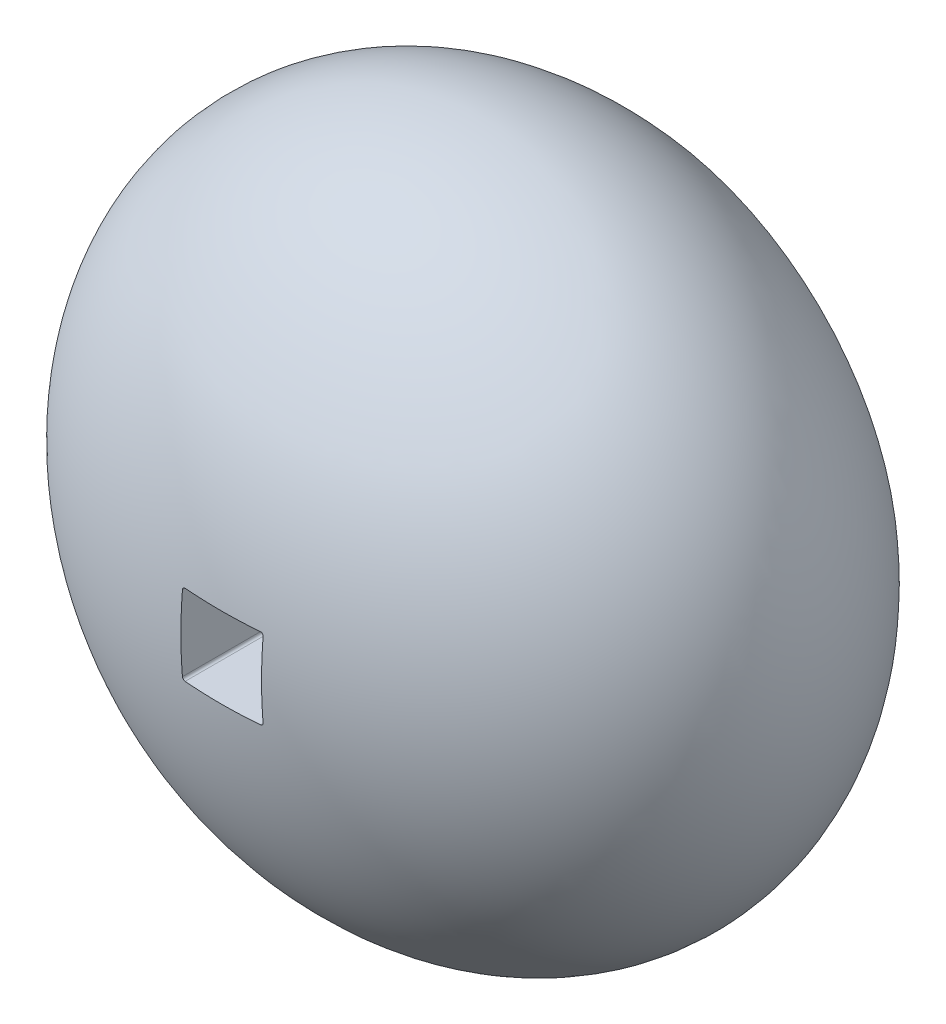
ISO-10303-21;
HEADER;
FILE_DESCRIPTION(('STEP AP214'),'2;1');
FILE_NAME('part.step','',(''),(''),'','','');
FILE_SCHEMA(('AUTOMOTIVE_DESIGN { 1 0 10303 214 1 1 1 1 }'));
ENDSEC;
DATA;
#1=APPLICATION_CONTEXT('core data for automotive mechanical design processes');
#2=APPLICATION_PROTOCOL_DEFINITION('international standard','automotive_design',2000,#1);
#3=PRODUCT_CONTEXT('',#1,'mechanical');
#4=PRODUCT('Part','Part','',(#3));
#5=PRODUCT_RELATED_PRODUCT_CATEGORY('part','',(#4));
#6=PRODUCT_DEFINITION_FORMATION('','',#4);
#7=PRODUCT_DEFINITION_CONTEXT('part definition',#1,'design');
#8=PRODUCT_DEFINITION('design','',#6,#7);
#9=PRODUCT_DEFINITION_SHAPE('','',#8);
#10=(LENGTH_UNIT() NAMED_UNIT(*) SI_UNIT(.MILLI.,.METRE.));
#11=(NAMED_UNIT(*) PLANE_ANGLE_UNIT() SI_UNIT($,.RADIAN.));
#12=(NAMED_UNIT(*) SI_UNIT($,.STERADIAN.) SOLID_ANGLE_UNIT());
#13=UNCERTAINTY_MEASURE_WITH_UNIT(LENGTH_MEASURE(1.E-05),#10,'distance_accuracy_value','');
#14=(GEOMETRIC_REPRESENTATION_CONTEXT(3) GLOBAL_UNCERTAINTY_ASSIGNED_CONTEXT((#13)) GLOBAL_UNIT_ASSIGNED_CONTEXT((#10,
#11,#12)) REPRESENTATION_CONTEXT('',''));
#15=CARTESIAN_POINT('',(0.,0.,0.));
#16=DIRECTION('',(0.,0.,1.));
#17=DIRECTION('',(1.,0.,0.));
#18=AXIS2_PLACEMENT_3D('',#15,#16,#17);
#19=CARTESIAN_POINT('',(0.,0.,0.));
#20=DIRECTION('',(0.,0.,1.));
#21=DIRECTION('',(1.,0.,0.));
#22=AXIS2_PLACEMENT_3D('',#19,#20,#21);
#23=PLANE('',#22);
#24=CARTESIAN_POINT('',(0.,0.,0.));
#25=DIRECTION('',(0.,0.,1.));
#26=DIRECTION('',(1.,0.,0.));
#27=AXIS2_PLACEMENT_3D('',#24,#25,#26);
#28=CIRCLE('',#27,19.5);
#29=CARTESIAN_POINT('',(19.5,0.,0.));
#30=VERTEX_POINT('',#29);
#31=EDGE_CURVE('E12',#30,#30,#28,.T.);
#32=ORIENTED_EDGE('',*,*,#31,.F.);
#33=EDGE_LOOP('',(#32));
#34=FACE_BOUND('',#33,.T.);
#35=CARTESIAN_POINT('',(0.,0.,0.));
#36=DIRECTION('',(0.,0.,1.));
#37=DIRECTION('',(1.,0.,0.));
#38=AXIS2_PLACEMENT_3D('',#35,#36,#37);
#39=CIRCLE('',#38,18.5);
#40=CARTESIAN_POINT('',(18.5,0.,0.));
#41=VERTEX_POINT('',#40);
#42=EDGE_CURVE('E269',#41,#41,#39,.T.);
#43=ORIENTED_EDGE('',*,*,#42,.T.);
#44=EDGE_LOOP('',(#43));
#45=FACE_BOUND('',#44,.T.);
#46=ADVANCED_FACE('F63',(#34,#45),#23,.F.);
#47=CARTESIAN_POINT('',(0.,0.,12.1479038822749));
#48=DIRECTION('',(1.,0.,0.));
#49=DIRECTION('',(0.,1.,0.));
#50=AXIS2_PLACEMENT_3D('',#47,#48,#49);
#51=ELLIPSE('',#50,25.5,18.8520961177251);
#52=TRIMMED_CURVE('',#51,(PARAMETER_VALUE(4.71238898038469)),
(PARAMETER_VALUE(7.85398163397448)),.T.,.PARAMETER.);
#53=CARTESIAN_POINT('',(0.,0.,1186.45838773338));
#54=DIRECTION('',(0.,0.,1.));
#55=AXIS1_PLACEMENT('',#53,#54);
#56=SURFACE_OF_REVOLUTION('',#52,#55);
#57=CARTESIAN_POINT('',(-3.,-2.8,30.7542854389864));
#58=CARTESIAN_POINT('',(-3.,-2.61345255434219,30.7696287091607));
#59=CARTESIAN_POINT('',(-3.,-2.42677847376478,30.7834304929131));
#60=CARTESIAN_POINT('',(-3.,-2.05342901212041,30.8079424453394));
#61=CARTESIAN_POINT('',(-3.,-1.86675384827409,30.8186559222903));
#62=CARTESIAN_POINT('',(-3.,-1.49340304087798,30.8370082061758));
#63=CARTESIAN_POINT('',(-3.,-1.30672751853067,30.8446494797139));
#64=CARTESIAN_POINT('',(-3.,-0.933376468467886,30.8568693732832));
#65=CARTESIAN_POINT('',(-3.,-0.746700994413011,30.8614496331072));
#66=CARTESIAN_POINT('',(-3.,-0.373350337951583,30.8675550766698));
#67=CARTESIAN_POINT('',(-3.,-0.186675168975792,30.8690810819289));
#68=CARTESIAN_POINT('',(-3.,0.186675168975791,30.8690810819288));
#69=CARTESIAN_POINT('',(-3.,0.373350337951582,30.8675550766698));
#70=CARTESIAN_POINT('',(-3.,0.746700994413009,30.8614496331072));
#71=CARTESIAN_POINT('',(-3.,0.933376468467882,30.8568693732831));
#72=CARTESIAN_POINT('',(-3.,1.30672751853067,30.8446494797138));
#73=CARTESIAN_POINT('',(-3.,1.49340304087798,30.8370082061759));
#74=CARTESIAN_POINT('',(-3.,1.86675384827409,30.8186559222904));
#75=CARTESIAN_POINT('',(-3.,2.05342901212041,30.8079424453394));
#76=CARTESIAN_POINT('',(-3.,2.42677847376478,30.783430492913));
#77=CARTESIAN_POINT('',(-3.,2.61345255434218,30.7696287091606));
#78=CARTESIAN_POINT('',(-3.,2.8,30.7542854389864));
#79=B_SPLINE_CURVE_WITH_KNOTS('',3,(#57,#58,#59,#60,#61,#62,#63,#64,#65,#66,#67,#68,#69,#70,#71,
#72,#73,#74,#75,#76,#77,#78),.UNSPECIFIED.,.F.,.F.,(4,2,2,2,2,2,2,2,2,2,4),(0.,
0.561525478558583,1.122447181425,1.68291762911274,2.2430875901916,2.80310685888383,
3.36312612757606,3.92329608865492,4.48376653634266,5.04468823920908,5.60621371776766),.UNSPECIFIED.);
#80=CARTESIAN_POINT('',(-3.,-2.8,30.7542854389864));
#81=VERTEX_POINT('',#80);
#82=CARTESIAN_POINT('',(-3.,2.8,30.7542854389864));
#83=VERTEX_POINT('',#82);
#84=EDGE_CURVE('E145',#81,#83,#79,.T.);
#85=ORIENTED_EDGE('',*,*,#84,.T.);
#86=CARTESIAN_POINT('',(-3.,2.8,30.7542854389864));
#87=CARTESIAN_POINT('',(-3.00000967177594,2.81119629806838,30.7533637490118));
#88=CARTESIAN_POINT('',(-2.99906034918853,2.82239731191214,30.7525204812984));
#89=CARTESIAN_POINT('',(-2.99530761704706,2.84448997016492,30.751011821607));
#90=CARTESIAN_POINT('',(-2.99250531745599,2.85538179571165,30.7503463234769));
#91=CARTESIAN_POINT('',(-2.98510806868469,2.87655808072974,30.7492127254614));
#92=CARTESIAN_POINT('',(-2.98051199333973,2.88684215396382,30.7487447499692));
#93=CARTESIAN_POINT('',(-2.9696588935551,2.90649783159489,30.7480205097188));
#94=CARTESIAN_POINT('',(-2.96340228018263,2.91586966103469,30.7477641926291));
#95=CARTESIAN_POINT('',(-2.94942934888167,2.93340202468106,30.7474713249619));
#96=CARTESIAN_POINT('',(-2.9417183504843,2.94156678555443,30.7474339889353));
#97=CARTESIAN_POINT('',(-2.92504156585535,2.95649218014754,30.7475780929724));
#98=CARTESIAN_POINT('',(-2.91607580228529,2.96325283922039,30.7477595290854));
#99=CARTESIAN_POINT('',(-2.89716010767741,2.97517063337091,30.74833529823));
#100=CARTESIAN_POINT('',(-2.88721155569745,2.98032997445649,30.7487293363078));
#101=CARTESIAN_POINT('',(-2.86660366436446,2.98891368250461,30.7497185924132));
#102=CARTESIAN_POINT('',(-2.85594466878268,2.99233888178929,30.7503137136996));
#103=CARTESIAN_POINT('',(-2.83769021633839,2.99656345935657,30.7514678723046));
#104=CARTESIAN_POINT('',(-2.83020096672447,2.99785178160071,30.7519779700933));
#105=CARTESIAN_POINT('',(-2.81514111194075,2.999570029264,30.7530754187787));
#106=CARTESIAN_POINT('',(-2.80757063817266,3.00000117746419,30.753662658353));
#107=CARTESIAN_POINT('',(-2.79999999999999,3.,30.7542854389864));
#108=B_SPLINE_CURVE_WITH_KNOTS('',3,(#86,#87,#88,#89,#90,#91,#92,#93,#94,#95,#96,#97,#98,#99,
#100,#101,#102,#103,#104,#105,#106,#107),.UNSPECIFIED.,.F.,.F.,(4,2,2,2,2,2,2,2,2,2,4),(0.,
0.0336597587481281,0.0672993730034857,0.100960140876041,0.134612583764552,0.168144246682056,
0.201675304083825,0.23515996126314,0.268628531807672,0.291431331406404,0.314201578811588),.UNSPECIFIED.);
#109=CARTESIAN_POINT('',(-2.8,3.,30.7542854389864));
#110=VERTEX_POINT('',#109);
#111=EDGE_CURVE('E129',#83,#110,#108,.T.);
#112=ORIENTED_EDGE('',*,*,#111,.T.);
#113=CARTESIAN_POINT('',(-2.8,3.,30.7542854389864));
#114=CARTESIAN_POINT('',(-2.61345255434218,3.,30.7696287091606));
#115=CARTESIAN_POINT('',(-2.42677847376478,3.,30.783430492913));
#116=CARTESIAN_POINT('',(-2.05342901212041,3.,30.8079424453394));
#117=CARTESIAN_POINT('',(-1.86675384827409,3.,30.8186559222904));
#118=CARTESIAN_POINT('',(-1.49340304087798,3.,30.8370082061759));
#119=CARTESIAN_POINT('',(-1.30672751853066,3.,30.8446494797138));
#120=CARTESIAN_POINT('',(-0.933376468467876,3.,30.8568693732831));
#121=CARTESIAN_POINT('',(-0.746700994413003,3.,30.8614496331071));
#122=CARTESIAN_POINT('',(-0.373350337951579,3.,30.8675550766698));
#123=CARTESIAN_POINT('',(-0.18667516897579,3.,30.8690810819289));
#124=CARTESIAN_POINT('',(0.186675168975789,3.,30.8690810819289));
#125=CARTESIAN_POINT('',(0.373350337951578,3.,30.8675550766698));
#126=CARTESIAN_POINT('',(0.746700994413002,3.,30.8614496331071));
#127=CARTESIAN_POINT('',(0.933376468467875,3.,30.8568693732831));
#128=CARTESIAN_POINT('',(1.30672751853066,3.,30.8446494797138));
#129=CARTESIAN_POINT('',(1.49340304087798,3.,30.8370082061759));
#130=CARTESIAN_POINT('',(1.86675384827409,3.,30.8186559222904));
#131=CARTESIAN_POINT('',(2.05342901212041,3.,30.8079424453394));
#132=CARTESIAN_POINT('',(2.42677847376477,3.,30.783430492913));
#133=CARTESIAN_POINT('',(2.61345255434218,3.,30.7696287091606));
#134=CARTESIAN_POINT('',(2.79999999999999,3.,30.7542854389864));
#135=B_SPLINE_CURVE_WITH_KNOTS('',3,(#113,#114,#115,#116,#117,#118,#119,#120,#121,#122,#123,
#124,#125,#126,#127,#128,#129,#130,#131,#132,#133,#134),.UNSPECIFIED.,.F.,.F.,(4,2,2,2,2,2,2,2,
2,2,4),(0.,0.561525478558583,1.122447181425,1.68291762911274,2.24308759019161,2.80310685888383,
3.36312612757605,3.92329608865492,4.48376653634266,5.04468823920907,5.60621371776766),.UNSPECIFIED.);
#136=CARTESIAN_POINT('',(2.8,3.,30.7542854389864));
#137=VERTEX_POINT('',#136);
#138=EDGE_CURVE('E135',#110,#137,#135,.T.);
#139=ORIENTED_EDGE('',*,*,#138,.T.);
#140=CARTESIAN_POINT('',(2.8,3.,30.7542854389864));
#141=CARTESIAN_POINT('',(2.81119629806838,3.00000967177594,30.7533637490118));
#142=CARTESIAN_POINT('',(2.82239731191214,2.99906034918853,30.7525204812984));
#143=CARTESIAN_POINT('',(2.84448997016492,2.99530761704706,30.751011821607));
#144=CARTESIAN_POINT('',(2.85538179571165,2.99250531745599,30.7503463234769));
#145=CARTESIAN_POINT('',(2.87655808072973,2.98510806868469,30.7492127254614));
#146=CARTESIAN_POINT('',(2.88684215396382,2.98051199333974,30.7487447499692));
#147=CARTESIAN_POINT('',(2.90649783159488,2.96965889355511,30.7480205097188));
#148=CARTESIAN_POINT('',(2.91586966103469,2.96340228018263,30.7477641926291));
#149=CARTESIAN_POINT('',(2.93340202468105,2.94942934888168,30.7474713249619));
#150=CARTESIAN_POINT('',(2.94156678555442,2.9417183504843,30.7474339889353));
#151=CARTESIAN_POINT('',(2.95649218014754,2.92504156585536,30.7475780929724));
#152=CARTESIAN_POINT('',(2.96325283922039,2.91607580228529,30.7477595290854));
#153=CARTESIAN_POINT('',(2.97517063337091,2.89716010767741,30.74833529823));
#154=CARTESIAN_POINT('',(2.98032997445649,2.88721155569746,30.7487293363078));
#155=CARTESIAN_POINT('',(2.9889136825046,2.86660366436447,30.7497185924132));
#156=CARTESIAN_POINT('',(2.99233888178929,2.85594466878268,30.7503137136996));
#157=CARTESIAN_POINT('',(2.99656345935656,2.83769021633839,30.7514678723046));
#158=CARTESIAN_POINT('',(2.99785178160071,2.83020096672447,30.7519779700933));
#159=CARTESIAN_POINT('',(2.999570029264,2.81514111194075,30.7530754187787));
#160=CARTESIAN_POINT('',(3.00000117746419,2.80757063817267,30.753662658353));
#161=CARTESIAN_POINT('',(3.,2.8,30.7542854389864));
#162=B_SPLINE_CURVE_WITH_KNOTS('',3,(#140,#141,#142,#143,#144,#145,#146,#147,#148,#149,#150,
#151,#152,#153,#154,#155,#156,#157,#158,#159,#160,#161),.UNSPECIFIED.,.F.,.F.,(4,2,2,2,2,2,2,2,
2,2,4),(0.,0.0336597587481265,0.0672993730034837,0.100960140876039,0.134612583764549,
0.168144246682053,0.201675304083822,0.235159961263138,0.26862853180767,0.291431331406403,
0.314201578811588),.UNSPECIFIED.);
#163=CARTESIAN_POINT('',(3.,2.8,30.7542854389864));
#164=VERTEX_POINT('',#163);
#165=EDGE_CURVE('E139',#137,#164,#162,.T.);
#166=ORIENTED_EDGE('',*,*,#165,.T.);
#167=CARTESIAN_POINT('',(3.,2.8,30.7542854389864));
#168=CARTESIAN_POINT('',(3.,2.61345255434218,30.7696287091606));
#169=CARTESIAN_POINT('',(3.,2.42677847376478,30.783430492913));
#170=CARTESIAN_POINT('',(3.,2.05342901212041,30.8079424453394));
#171=CARTESIAN_POINT('',(3.,1.86675384827409,30.8186559222904));
#172=CARTESIAN_POINT('',(3.,1.49340304087799,30.8370082061759));
#173=CARTESIAN_POINT('',(3.,1.30672751853067,30.8446494797138));
#174=CARTESIAN_POINT('',(3.,0.933376468467883,30.8568693732831));
#175=CARTESIAN_POINT('',(3.,0.74670099441301,30.8614496331072));
#176=CARTESIAN_POINT('',(3.,0.373350337951584,30.8675550766698));
#177=CARTESIAN_POINT('',(3.,0.186675168975793,30.8690810819288));
#178=CARTESIAN_POINT('',(3.,-0.18667516897579,30.8690810819289));
#179=CARTESIAN_POINT('',(3.,-0.373350337951581,30.8675550766698));
#180=CARTESIAN_POINT('',(3.,-0.746700994413009,30.8614496331072));
#181=CARTESIAN_POINT('',(3.,-0.933376468467883,30.8568693732832));
#182=CARTESIAN_POINT('',(3.,-1.30672751853067,30.8446494797139));
#183=CARTESIAN_POINT('',(3.,-1.49340304087798,30.8370082061758));
#184=CARTESIAN_POINT('',(3.,-1.86675384827409,30.8186559222903));
#185=CARTESIAN_POINT('',(3.,-2.05342901212041,30.8079424453394));
#186=CARTESIAN_POINT('',(3.,-2.42677847376478,30.7834304929131));
#187=CARTESIAN_POINT('',(3.,-2.61345255434218,30.7696287091607));
#188=CARTESIAN_POINT('',(3.,-2.79999999999999,30.7542854389864));
#189=B_SPLINE_CURVE_WITH_KNOTS('',3,(#167,#168,#169,#170,#171,#172,#173,#174,#175,#176,#177,
#178,#179,#180,#181,#182,#183,#184,#185,#186,#187,#188),.UNSPECIFIED.,.F.,.F.,(4,2,2,2,2,2,2,2,
2,2,4),(0.,0.561525478558582,1.122447181425,1.68291762911274,2.2430875901916,2.80310685888383,
3.36312612757606,3.92329608865492,4.48376653634266,5.04468823920908,5.60621371776766),.UNSPECIFIED.);
#190=CARTESIAN_POINT('',(3.,-2.8,30.7542854389864));
#191=VERTEX_POINT('',#190);
#192=EDGE_CURVE('E362',#164,#191,#189,.T.);
#193=ORIENTED_EDGE('',*,*,#192,.T.);
#194=CARTESIAN_POINT('',(3.,-2.8,30.7542854389864));
#195=CARTESIAN_POINT('',(3.00000967177594,-2.81119629806837,30.7533637490116));
#196=CARTESIAN_POINT('',(2.99906034918854,-2.82239731191213,30.7525204812983));
#197=CARTESIAN_POINT('',(2.99530761704706,-2.84448997016491,30.7510118216069));
#198=CARTESIAN_POINT('',(2.99250531745599,-2.85538179571164,30.7503463234769));
#199=CARTESIAN_POINT('',(2.98510806868469,-2.87655808072974,30.7492127254615));
#200=CARTESIAN_POINT('',(2.98051199333973,-2.88684215396382,30.7487447499692));
#201=CARTESIAN_POINT('',(2.9696588935551,-2.90649783159489,30.7480205097189));
#202=CARTESIAN_POINT('',(2.96340228018263,-2.91586966103469,30.7477641926291));
#203=CARTESIAN_POINT('',(2.94942934888167,-2.93340202468106,30.7474713249619));
#204=CARTESIAN_POINT('',(2.9417183504843,-2.94156678555442,30.7474339889354));
#205=CARTESIAN_POINT('',(2.92504156585535,-2.95649218014754,30.7475780929725));
#206=CARTESIAN_POINT('',(2.91607580228529,-2.96325283922039,30.7477595290854));
#207=CARTESIAN_POINT('',(2.89716010767741,-2.97517063337091,30.74833529823));
#208=CARTESIAN_POINT('',(2.88721155569746,-2.98032997445649,30.7487293363078));
#209=CARTESIAN_POINT('',(2.86660366436447,-2.9889136825046,30.7497185924133));
#210=CARTESIAN_POINT('',(2.85594466878268,-2.99233888178929,30.7503137136996));
#211=CARTESIAN_POINT('',(2.83769021633839,-2.99656345935657,30.7514678723046));
#212=CARTESIAN_POINT('',(2.83020096672446,-2.99785178160071,30.7519779700933));
#213=CARTESIAN_POINT('',(2.81514111194074,-2.999570029264,30.7530754187786));
#214=CARTESIAN_POINT('',(2.80757063817266,-3.00000117746419,30.753662658353));
#215=CARTESIAN_POINT('',(2.8,-3.,30.7542854389864));
#216=B_SPLINE_CURVE_WITH_KNOTS('',3,(#194,#195,#196,#197,#198,#199,#200,#201,#202,#203,#204,
#205,#206,#207,#208,#209,#210,#211,#212,#213,#214,#215),.UNSPECIFIED.,.F.,.F.,(4,2,2,2,2,2,2,2,
2,2,4),(0.,0.0336597587481283,0.0672993730034872,0.100960140876043,0.134612583764553,
0.168144246682057,0.201675304083824,0.235159961263139,0.26862853180767,0.291431331406402,
0.314201578811586),.UNSPECIFIED.);
#217=CARTESIAN_POINT('',(2.8,-3.,30.7542854389864));
#218=VERTEX_POINT('',#217);
#219=EDGE_CURVE('E360',#191,#218,#216,.T.);
#220=ORIENTED_EDGE('',*,*,#219,.T.);
#221=CARTESIAN_POINT('',(2.8,-3.,30.7542854389864));
#222=CARTESIAN_POINT('',(2.61345255434219,-3.,30.7696287091608));
#223=CARTESIAN_POINT('',(2.42677847376478,-3.,30.7834304929131));
#224=CARTESIAN_POINT('',(2.05342901212041,-3.,30.8079424453394));
#225=CARTESIAN_POINT('',(1.86675384827409,-3.,30.8186559222903));
#226=CARTESIAN_POINT('',(1.49340304087799,-3.,30.8370082061758));
#227=CARTESIAN_POINT('',(1.30672751853067,-3.,30.8446494797139));
#228=CARTESIAN_POINT('',(0.933376468467892,-3.,30.8568693732833));
#229=CARTESIAN_POINT('',(0.746700994413018,-3.,30.8614496331073));
#230=CARTESIAN_POINT('',(0.373350337951588,-3.,30.8675550766699));
#231=CARTESIAN_POINT('',(0.186675168975794,-3.,30.8690810819288));
#232=CARTESIAN_POINT('',(-0.186675168975792,-3.,30.8690810819288));
#233=CARTESIAN_POINT('',(-0.373350337951586,-3.,30.8675550766699));
#234=CARTESIAN_POINT('',(-0.746700994413016,-3.,30.8614496331073));
#235=CARTESIAN_POINT('',(-0.93337646846789,-3.,30.8568693732833));
#236=CARTESIAN_POINT('',(-1.30672751853067,-3.,30.8446494797139));
#237=CARTESIAN_POINT('',(-1.49340304087798,-3.,30.8370082061758));
#238=CARTESIAN_POINT('',(-1.86675384827409,-3.,30.8186559222903));
#239=CARTESIAN_POINT('',(-2.05342901212041,-3.,30.8079424453394));
#240=CARTESIAN_POINT('',(-2.42677847376478,-3.,30.7834304929131));
#241=CARTESIAN_POINT('',(-2.61345255434219,-3.,30.7696287091608));
#242=CARTESIAN_POINT('',(-2.8,-3.,30.7542854389864));
#243=B_SPLINE_CURVE_WITH_KNOTS('',3,(#221,#222,#223,#224,#225,#226,#227,#228,#229,#230,#231,
#232,#233,#234,#235,#236,#237,#238,#239,#240,#241,#242),.UNSPECIFIED.,.F.,.F.,(4,2,2,2,2,2,2,2,
2,2,4),(0.,0.561525478558582,1.122447181425,1.68291762911274,2.2430875901916,2.80310685888383,
3.36312612757606,3.92329608865493,4.48376653634267,5.04468823920908,5.60621371776766),.UNSPECIFIED.);
#244=CARTESIAN_POINT('',(-2.8,-3.,30.7542854389864));
#245=VERTEX_POINT('',#244);
#246=EDGE_CURVE('E387',#218,#245,#243,.T.);
#247=ORIENTED_EDGE('',*,*,#246,.T.);
#248=CARTESIAN_POINT('',(-2.8,-3.,30.7542854389864));
#249=CARTESIAN_POINT('',(-2.81119629806837,-3.00000967177594,30.7533637490116));
#250=CARTESIAN_POINT('',(-2.82239731191213,-2.99906034918853,30.7525204812983));
#251=CARTESIAN_POINT('',(-2.84448997016491,-2.99530761704706,30.7510118216069));
#252=CARTESIAN_POINT('',(-2.85538179571165,-2.99250531745599,30.7503463234769));
#253=CARTESIAN_POINT('',(-2.87655808072974,-2.98510806868469,30.7492127254615));
#254=CARTESIAN_POINT('',(-2.88684215396382,-2.98051199333973,30.7487447499692));
#255=CARTESIAN_POINT('',(-2.90649783159489,-2.9696588935551,30.7480205097189));
#256=CARTESIAN_POINT('',(-2.91586966103469,-2.96340228018263,30.7477641926291));
#257=CARTESIAN_POINT('',(-2.93340202468106,-2.94942934888167,30.7474713249619));
#258=CARTESIAN_POINT('',(-2.94156678555443,-2.9417183504843,30.7474339889354));
#259=CARTESIAN_POINT('',(-2.95649218014754,-2.92504156585535,30.7475780929725));
#260=CARTESIAN_POINT('',(-2.96325283922039,-2.91607580228529,30.7477595290854));
#261=CARTESIAN_POINT('',(-2.97517063337091,-2.89716010767741,30.74833529823));
#262=CARTESIAN_POINT('',(-2.98032997445649,-2.88721155569745,30.7487293363078));
#263=CARTESIAN_POINT('',(-2.9889136825046,-2.86660366436447,30.7497185924133));
#264=CARTESIAN_POINT('',(-2.99233888178929,-2.85594466878268,30.7503137136996));
#265=CARTESIAN_POINT('',(-2.99656345935657,-2.83769021633839,30.7514678723046));
#266=CARTESIAN_POINT('',(-2.99785178160071,-2.83020096672446,30.7519779700933));
#267=CARTESIAN_POINT('',(-2.999570029264,-2.81514111194074,30.7530754187786));
#268=CARTESIAN_POINT('',(-3.00000117746419,-2.80757063817266,30.753662658353));
#269=CARTESIAN_POINT('',(-3.,-2.8,30.7542854389864));
#270=B_SPLINE_CURVE_WITH_KNOTS('',3,(#248,#249,#250,#251,#252,#253,#254,#255,#256,#257,#258,
#259,#260,#261,#262,#263,#264,#265,#266,#267,#268,#269),.UNSPECIFIED.,.F.,.F.,(4,2,2,2,2,2,2,2,
2,2,4),(0.,0.0336597587481282,0.0672993730034882,0.100960140876044,0.134612583764554,
0.168144246682058,0.201675304083825,0.23515996126314,0.26862853180767,0.291431331406402,
0.314201578811585),.UNSPECIFIED.);
#271=EDGE_CURVE('E151',#245,#81,#270,.T.);
#272=ORIENTED_EDGE('',*,*,#271,.T.);
#273=EDGE_LOOP('',(#85,#112,#139,#166,#193,#220,#247,#272));
#274=FACE_BOUND('',#273,.T.);
#275=ORIENTED_EDGE('',*,*,#31,.T.);
#276=EDGE_LOOP('',(#275));
#277=FACE_BOUND('',#276,.T.);
#278=ADVANCED_FACE('F141',(#274,#277),#56,.T.);
#279=CARTESIAN_POINT('',(0.,0.,4.50999256942048));
#280=DIRECTION('',(0.,0.,1.));
#281=DIRECTION('',(1.,0.,0.));
#282=AXIS2_PLACEMENT_3D('',#279,#280,#281);
#283=PLANE('',#282);
#284=CARTESIAN_POINT('',(0.,0.,4.50999256941031));
#285=DIRECTION('',(0.,0.,1.));
#286=DIRECTION('',(1.,0.,0.));
#287=AXIS2_PLACEMENT_3D('',#284,#285,#286);
#288=CIRCLE('',#287,5.);
#289=CARTESIAN_POINT('',(-5.,0.,4.50999256941031));
#290=VERTEX_POINT('',#289);
#291=EDGE_CURVE('E251',#290,#290,#288,.F.);
#292=ORIENTED_EDGE('',*,*,#291,.F.);
#293=EDGE_LOOP('',(#292));
#294=FACE_BOUND('',#293,.T.);
#295=CARTESIAN_POINT('',(0.,0.,4.50999256942053));
#296=DIRECTION('',(0.,0.,1.));
#297=DIRECTION('',(1.,0.,0.));
#298=AXIS2_PLACEMENT_3D('',#295,#296,#297);
#299=CIRCLE('',#298,16.);
#300=CARTESIAN_POINT('',(16.,0.,4.50999256942053));
#301=VERTEX_POINT('',#300);
#302=EDGE_CURVE('E71',#301,#301,#299,.T.);
#303=ORIENTED_EDGE('',*,*,#302,.F.);
#304=EDGE_LOOP('',(#303));
#305=FACE_BOUND('',#304,.T.);
#306=ADVANCED_FACE('F283',(#294,#305),#283,.F.);
#307=CARTESIAN_POINT('',(0.,0.,1186.45838773338));
#308=DIRECTION('',(0.,0.,1.));
#309=DIRECTION('',(1.,0.,0.));
#310=AXIS2_PLACEMENT_3D('',#307,#308,#309);
#311=CYLINDRICAL_SURFACE('',#310,16.);
#312=ORIENTED_EDGE('',*,*,#302,.T.);
#313=EDGE_LOOP('',(#312));
#314=FACE_BOUND('',#313,.T.);
#315=CARTESIAN_POINT('',(0.,0.,3.50000000000006));
#316=DIRECTION('',(0.,0.,1.));
#317=DIRECTION('',(1.,0.,0.));
#318=AXIS2_PLACEMENT_3D('',#315,#316,#317);
#319=CIRCLE('',#318,16.);
#320=CARTESIAN_POINT('',(16.,0.,3.50000000000006));
#321=VERTEX_POINT('',#320);
#322=EDGE_CURVE('E275',#321,#321,#319,.T.);
#323=ORIENTED_EDGE('',*,*,#322,.F.);
#324=EDGE_LOOP('',(#323));
#325=FACE_BOUND('',#324,.T.);
#326=ADVANCED_FACE('F280',(#314,#325),#311,.F.);
#327=CARTESIAN_POINT('',(0.,0.,3.50000000000003));
#328=DIRECTION('',(0.,0.,-1.));
#329=DIRECTION('',(-1.,0.,0.));
#330=AXIS2_PLACEMENT_3D('',#327,#328,#329);
#331=PLANE('',#330);
#332=ORIENTED_EDGE('',*,*,#322,.T.);
#333=EDGE_LOOP('',(#332));
#334=FACE_BOUND('',#333,.T.);
#335=CARTESIAN_POINT('',(0.,0.,3.50000000000006));
#336=DIRECTION('',(0.,0.,1.));
#337=DIRECTION('',(1.,0.,0.));
#338=AXIS2_PLACEMENT_3D('',#335,#336,#337);
#339=CIRCLE('',#338,18.5);
#340=CARTESIAN_POINT('',(18.5,0.,3.50000000000006));
#341=VERTEX_POINT('',#340);
#342=EDGE_CURVE('E272',#341,#341,#339,.T.);
#343=ORIENTED_EDGE('',*,*,#342,.F.);
#344=EDGE_LOOP('',(#343));
#345=FACE_BOUND('',#344,.T.);
#346=ADVANCED_FACE('F290',(#334,#345),#331,.T.);
#347=CARTESIAN_POINT('',(0.,0.,1186.45838773338));
#348=DIRECTION('',(0.,0.,1.));
#349=DIRECTION('',(1.,0.,0.));
#350=AXIS2_PLACEMENT_3D('',#347,#348,#349);
#351=CYLINDRICAL_SURFACE('',#350,18.5);
#352=ORIENTED_EDGE('',*,*,#342,.T.);
#353=EDGE_LOOP('',(#352));
#354=FACE_BOUND('',#353,.T.);
#355=ORIENTED_EDGE('',*,*,#42,.F.);
#356=EDGE_LOOP('',(#355));
#357=FACE_BOUND('',#356,.T.);
#358=ADVANCED_FACE('F183',(#354,#357),#351,.F.);
#359=CARTESIAN_POINT('',(-3.,2.8,500000.));
#360=DIRECTION('',(-1.,0.,0.));
#361=DIRECTION('',(0.,-1.,0.));
#362=AXIS2_PLACEMENT_3D('',#359,#360,#361);
#363=PLANE('',#362);
#364=DIRECTION('',(0.,0.,-1.));
#365=VECTOR('',#364,1.);
#366=CARTESIAN_POINT('',(-3.,2.8,500000.));
#367=LINE('',#366,#365);
#368=CARTESIAN_POINT('',(-3.,2.8,0.));
#369=VERTEX_POINT('',#368);
#370=EDGE_CURVE('E321',#83,#369,#367,.T.);
#371=ORIENTED_EDGE('',*,*,#370,.F.);
#372=ORIENTED_EDGE('',*,*,#84,.F.);
#373=DIRECTION('',(0.,0.,-1.));
#374=VECTOR('',#373,1.);
#375=CARTESIAN_POINT('',(-3.,-2.8,500000.));
#376=LINE('',#375,#374);
#377=CARTESIAN_POINT('',(-3.,-2.8,0.));
#378=VERTEX_POINT('',#377);
#379=EDGE_CURVE('E322',#81,#378,#376,.T.);
#380=ORIENTED_EDGE('',*,*,#379,.T.);
#381=DIRECTION('',(0.,1.,0.));
#382=VECTOR('',#381,1.);
#383=CARTESIAN_POINT('',(-3.,2.8,0.));
#384=LINE('',#383,#382);
#385=EDGE_CURVE('E149',#378,#369,#384,.T.);
#386=ORIENTED_EDGE('',*,*,#385,.T.);
#387=EDGE_LOOP('',(#371,#372,#380,#386));
#388=FACE_BOUND('',#387,.T.);
#389=ADVANCED_FACE('F202',(#388),#363,.F.);
#390=CARTESIAN_POINT('',(-2.8,-2.8,500000.));
#391=DIRECTION('',(0.,0.,-1.));
#392=DIRECTION('',(-1.,0.,0.));
#393=AXIS2_PLACEMENT_3D('',#390,#391,#392);
#394=CYLINDRICAL_SURFACE('',#393,0.2);
#395=ORIENTED_EDGE('',*,*,#379,.F.);
#396=ORIENTED_EDGE('',*,*,#271,.F.);
#397=DIRECTION('',(0.,0.,-1.));
#398=VECTOR('',#397,1.);
#399=CARTESIAN_POINT('',(-2.8,-3.,500000.));
#400=LINE('',#399,#398);
#401=CARTESIAN_POINT('',(-2.8,-3.,0.));
#402=VERTEX_POINT('',#401);
#403=EDGE_CURVE('E324',#245,#402,#400,.T.);
#404=ORIENTED_EDGE('',*,*,#403,.T.);
#405=CARTESIAN_POINT('',(-2.8,-2.8,0.));
#406=DIRECTION('',(0.,0.,-1.));
#407=DIRECTION('',(-1.,0.,0.));
#408=AXIS2_PLACEMENT_3D('',#405,#406,#407);
#409=CIRCLE('',#408,0.2);
#410=EDGE_CURVE('E338',#402,#378,#409,.T.);
#411=ORIENTED_EDGE('',*,*,#410,.T.);
#412=EDGE_LOOP('',(#395,#396,#404,#411));
#413=FACE_BOUND('',#412,.T.);
#414=ADVANCED_FACE('F198',(#413),#394,.F.);
#415=CARTESIAN_POINT('',(2.8,-3.,500000.));
#416=DIRECTION('',(0.,-1.,0.));
#417=DIRECTION('',(0.,0.,-1.));
#418=AXIS2_PLACEMENT_3D('',#415,#416,#417);
#419=PLANE('',#418);
#420=ORIENTED_EDGE('',*,*,#403,.F.);
#421=ORIENTED_EDGE('',*,*,#246,.F.);
#422=DIRECTION('',(0.,0.,-1.));
#423=VECTOR('',#422,1.);
#424=CARTESIAN_POINT('',(2.8,-3.,500000.));
#425=LINE('',#424,#423);
#426=CARTESIAN_POINT('',(2.8,-3.,0.));
#427=VERTEX_POINT('',#426);
#428=EDGE_CURVE('E327',#218,#427,#425,.T.);
#429=ORIENTED_EDGE('',*,*,#428,.T.);
#430=DIRECTION('',(-1.,0.,0.));
#431=VECTOR('',#430,1.);
#432=CARTESIAN_POINT('',(2.8,-3.,0.));
#433=LINE('',#432,#431);
#434=EDGE_CURVE('E342',#427,#402,#433,.T.);
#435=ORIENTED_EDGE('',*,*,#434,.T.);
#436=EDGE_LOOP('',(#420,#421,#429,#435));
#437=FACE_BOUND('',#436,.T.);
#438=ADVANCED_FACE('F194',(#437),#419,.F.);
#439=CARTESIAN_POINT('',(2.8,-2.8,500000.));
#440=DIRECTION('',(0.,0.,-1.));
#441=DIRECTION('',(-1.,0.,0.));
#442=AXIS2_PLACEMENT_3D('',#439,#440,#441);
#443=CYLINDRICAL_SURFACE('',#442,0.2);
#444=ORIENTED_EDGE('',*,*,#428,.F.);
#445=ORIENTED_EDGE('',*,*,#219,.F.);
#446=DIRECTION('',(0.,0.,-1.));
#447=VECTOR('',#446,1.);
#448=CARTESIAN_POINT('',(3.,-2.8,500000.));
#449=LINE('',#448,#447);
#450=CARTESIAN_POINT('',(3.,-2.8,0.));
#451=VERTEX_POINT('',#450);
#452=EDGE_CURVE('E329',#191,#451,#449,.T.);
#453=ORIENTED_EDGE('',*,*,#452,.T.);
#454=CARTESIAN_POINT('',(2.8,-2.8,0.));
#455=DIRECTION('',(0.,0.,-1.));
#456=DIRECTION('',(-1.,0.,0.));
#457=AXIS2_PLACEMENT_3D('',#454,#455,#456);
#458=CIRCLE('',#457,0.2);
#459=EDGE_CURVE('E345',#451,#427,#458,.T.);
#460=ORIENTED_EDGE('',*,*,#459,.T.);
#461=EDGE_LOOP('',(#444,#445,#453,#460));
#462=FACE_BOUND('',#461,.T.);
#463=ADVANCED_FACE('F190',(#462),#443,.F.);
#464=CARTESIAN_POINT('',(3.,2.8,500000.));
#465=DIRECTION('',(1.,0.,0.));
#466=DIRECTION('',(0.,1.,0.));
#467=AXIS2_PLACEMENT_3D('',#464,#465,#466);
#468=PLANE('',#467);
#469=ORIENTED_EDGE('',*,*,#452,.F.);
#470=ORIENTED_EDGE('',*,*,#192,.F.);
#471=DIRECTION('',(0.,0.,-1.));
#472=VECTOR('',#471,1.);
#473=CARTESIAN_POINT('',(3.,2.8,500000.));
#474=LINE('',#473,#472);
#475=CARTESIAN_POINT('',(3.,2.8,0.));
#476=VERTEX_POINT('',#475);
#477=EDGE_CURVE('E331',#164,#476,#474,.T.);
#478=ORIENTED_EDGE('',*,*,#477,.T.);
#479=DIRECTION('',(0.,-1.,0.));
#480=VECTOR('',#479,1.);
#481=CARTESIAN_POINT('',(3.,2.8,0.));
#482=LINE('',#481,#480);
#483=EDGE_CURVE('E347',#476,#451,#482,.T.);
#484=ORIENTED_EDGE('',*,*,#483,.T.);
#485=EDGE_LOOP('',(#469,#470,#478,#484));
#486=FACE_BOUND('',#485,.T.);
#487=ADVANCED_FACE('F186',(#486),#468,.F.);
#488=CARTESIAN_POINT('',(2.8,2.8,500000.));
#489=DIRECTION('',(0.,0.,-1.));
#490=DIRECTION('',(-1.,0.,0.));
#491=AXIS2_PLACEMENT_3D('',#488,#489,#490);
#492=CYLINDRICAL_SURFACE('',#491,0.2);
#493=ORIENTED_EDGE('',*,*,#477,.F.);
#494=ORIENTED_EDGE('',*,*,#165,.F.);
#495=DIRECTION('',(0.,0.,-1.));
#496=VECTOR('',#495,1.);
#497=CARTESIAN_POINT('',(2.8,3.,500000.));
#498=LINE('',#497,#496);
#499=CARTESIAN_POINT('',(2.8,3.,0.));
#500=VERTEX_POINT('',#499);
#501=EDGE_CURVE('E78',#137,#500,#498,.T.);
#502=ORIENTED_EDGE('',*,*,#501,.T.);
#503=CARTESIAN_POINT('',(2.8,2.8,0.));
#504=DIRECTION('',(0.,0.,-1.));
#505=DIRECTION('',(-1.,0.,0.));
#506=AXIS2_PLACEMENT_3D('',#503,#504,#505);
#507=CIRCLE('',#506,0.2);
#508=EDGE_CURVE('E163',#500,#476,#507,.T.);
#509=ORIENTED_EDGE('',*,*,#508,.T.);
#510=EDGE_LOOP('',(#493,#494,#502,#509));
#511=FACE_BOUND('',#510,.T.);
#512=ADVANCED_FACE('F177',(#511),#492,.F.);
#513=CARTESIAN_POINT('',(0.,0.,0.));
#514=DIRECTION('',(0.,0.,-1.));
#515=DIRECTION('',(-1.,0.,0.));
#516=AXIS2_PLACEMENT_3D('',#513,#514,#515);
#517=PLANE('',#516);
#518=CARTESIAN_POINT('',(-2.8,2.8,0.));
#519=DIRECTION('',(0.,0.,-1.));
#520=DIRECTION('',(1.,0.,0.));
#521=AXIS2_PLACEMENT_3D('',#518,#519,#520);
#522=CIRCLE('',#521,0.2);
#523=CARTESIAN_POINT('',(-2.8,3.,0.));
#524=VERTEX_POINT('',#523);
#525=EDGE_CURVE('E132',#369,#524,#522,.T.);
#526=ORIENTED_EDGE('',*,*,#525,.F.);
#527=ORIENTED_EDGE('',*,*,#385,.F.);
#528=ORIENTED_EDGE('',*,*,#410,.F.);
#529=ORIENTED_EDGE('',*,*,#434,.F.);
#530=ORIENTED_EDGE('',*,*,#459,.F.);
#531=ORIENTED_EDGE('',*,*,#483,.F.);
#532=ORIENTED_EDGE('',*,*,#508,.F.);
#533=DIRECTION('',(1.,0.,0.));
#534=VECTOR('',#533,1.);
#535=CARTESIAN_POINT('',(2.8,3.,0.));
#536=LINE('',#535,#534);
#537=EDGE_CURVE('E335',#524,#500,#536,.T.);
#538=ORIENTED_EDGE('',*,*,#537,.F.);
#539=EDGE_LOOP('',(#526,#527,#528,#529,#530,#531,#532,#538));
#540=FACE_BOUND('',#539,.T.);
#541=CARTESIAN_POINT('',(0.,0.,0.));
#542=DIRECTION('',(0.,0.,-1.));
#543=DIRECTION('',(-1.,0.,0.));
#544=AXIS2_PLACEMENT_3D('',#541,#542,#543);
#545=CIRCLE('',#544,5.);
#546=CARTESIAN_POINT('',(-5.,0.,0.));
#547=VERTEX_POINT('',#546);
#548=EDGE_CURVE('E146',#547,#547,#545,.T.);
#549=ORIENTED_EDGE('',*,*,#548,.T.);
#550=EDGE_LOOP('',(#549));
#551=FACE_BOUND('',#550,.T.);
#552=ADVANCED_FACE('F173',(#540,#551),#517,.T.);
#553=CARTESIAN_POINT('',(0.,0.,500000.));
#554=DIRECTION('',(0.,0.,-1.));
#555=DIRECTION('',(-1.,0.,0.));
#556=AXIS2_PLACEMENT_3D('',#553,#554,#555);
#557=CYLINDRICAL_SURFACE('',#556,5.);
#558=CARTESIAN_POINT('',(-5.,0.,0.));
#559=CARTESIAN_POINT('',(-5.,0.,0.0469790892717963));
#560=CARTESIAN_POINT('',(-5.,0.,0.0939581785435925));
#561=CARTESIAN_POINT('',(-5.,0.,0.187916357068237));
#562=CARTESIAN_POINT('',(-5.,0.,0.234895446321085));
#563=CARTESIAN_POINT('',(-5.,0.,0.32885362484573));
#564=CARTESIAN_POINT('',(-5.,0.,0.375832714117526));
#565=CARTESIAN_POINT('',(-5.,0.,0.469790892642171));
#566=CARTESIAN_POINT('',(-5.,0.,0.516769981895019));
#567=CARTESIAN_POINT('',(-5.,0.,0.610728160419664));
#568=CARTESIAN_POINT('',(-5.,0.,0.65770724969146));
#569=CARTESIAN_POINT('',(-5.,0.,0.751665428235052));
#570=CARTESIAN_POINT('',(-5.,0.,0.798644517506849));
#571=CARTESIAN_POINT('',(-5.,0.,0.892602696031493));
#572=CARTESIAN_POINT('',(-5.,0.,0.939581785284342));
#573=CARTESIAN_POINT('',(-5.,0.,1.03353996380899));
#574=CARTESIAN_POINT('',(-5.,0.,1.08051905308078));
#575=CARTESIAN_POINT('',(-5.,0.,1.17447723162438));
#576=CARTESIAN_POINT('',(-5.,0.,1.22145632089617));
#577=CARTESIAN_POINT('',(-5.,0.,1.31541449942082));
#578=CARTESIAN_POINT('',(-5.,0.,1.36239358867366));
#579=CARTESIAN_POINT('',(-5.,0.,1.45635176719831));
#580=CARTESIAN_POINT('',(-5.,0.,1.5033308564701));
#581=CARTESIAN_POINT('',(-5.,0.,1.5972890350137));
#582=CARTESIAN_POINT('',(-5.,0.,1.64426812428549));
#583=CARTESIAN_POINT('',(-5.,0.,1.73822630281014));
#584=CARTESIAN_POINT('',(-5.,0.,1.78520539206299));
#585=CARTESIAN_POINT('',(-5.,0.,1.87916357058763));
#586=CARTESIAN_POINT('',(-5.,0.,1.92614265985943));
#587=CARTESIAN_POINT('',(-5.,0.,2.02010083838407));
#588=CARTESIAN_POINT('',(-5.,0.,2.06707992763692));
#589=CARTESIAN_POINT('',(-5.,0.,2.16103810616156));
#590=CARTESIAN_POINT('',(-5.,0.,2.20801719543336));
#591=CARTESIAN_POINT('',(-5.,0.,2.30197537397695));
#592=CARTESIAN_POINT('',(-5.,0.,2.34895446324875));
#593=CARTESIAN_POINT('',(-5.,0.,2.44291264177339));
#594=CARTESIAN_POINT('',(-5.,0.,2.48989173102624));
#595=CARTESIAN_POINT('',(-5.,0.,2.58384990955089));
#596=CARTESIAN_POINT('',(-5.,0.,2.63082899882268));
#597=CARTESIAN_POINT('',(-5.,0.,2.72478717734733));
#598=CARTESIAN_POINT('',(-5.,0.,2.77176626660018));
#599=CARTESIAN_POINT('',(-5.,0.,2.86572444512482));
#600=CARTESIAN_POINT('',(-5.,0.,2.91270353439662));
#601=CARTESIAN_POINT('',(-5.,0.,3.00666171294021));
#602=CARTESIAN_POINT('',(-5.,0.,3.05364080221201));
#603=CARTESIAN_POINT('',(-5.,0.,3.14759898073665));
#604=CARTESIAN_POINT('',(-5.,0.,3.1945780699895));
#605=CARTESIAN_POINT('',(-5.,0.,3.28853624851414));
#606=CARTESIAN_POINT('',(-5.,0.,3.33551533778594));
#607=CARTESIAN_POINT('',(-5.,0.,3.42947351632953));
#608=CARTESIAN_POINT('',(-5.,0.,3.47645260560133));
#609=CARTESIAN_POINT('',(-5.,0.,3.57041078412597));
#610=CARTESIAN_POINT('',(-5.,0.,3.61738987337882));
#611=CARTESIAN_POINT('',(-5.,0.,3.71134805190347));
#612=CARTESIAN_POINT('',(-5.,0.,3.75832714117526));
#613=CARTESIAN_POINT('',(-5.,0.,3.85228531971885));
#614=CARTESIAN_POINT('',(-5.,0.,3.89926440899065));
#615=CARTESIAN_POINT('',(-5.,0.,3.9932225875153));
#616=CARTESIAN_POINT('',(-5.,0.,4.04020167676814));
#617=CARTESIAN_POINT('',(-5.,0.,4.13415985529279));
#618=CARTESIAN_POINT('',(-5.,0.,4.18113894456458));
#619=CARTESIAN_POINT('',(-5.,0.,4.27509712308923));
#620=CARTESIAN_POINT('',(-5.,0.,4.32207621234208));
#621=CARTESIAN_POINT('',(-5.,0.,4.41603439086672));
#622=CARTESIAN_POINT('',(-5.,0.,4.46301348013852));
#623=CARTESIAN_POINT('',(-5.,0.,4.50999256941031));
#624=B_SPLINE_CURVE_WITH_KNOTS('',3,(#558,#559,#560,#561,#562,#563,#564,#565,#566,#567,#568,
#569,#570,#571,#572,#573,#574,#575,#576,#577,#578,#579,#580,#581,#582,#583,#584,#585,#586,#587,
#588,#589,#590,#591,#592,#593,#594,#595,#596,#597,#598,#599,#600,#601,#602,#603,#604,#605,#606,
#607,#608,#609,#610,#611,#612,#613,#614,#615,#616,#617,#618,#619,#620,#621,#622,#623),
.UNSPECIFIED.,.F.,.F.,(4,2,2,2,2,2,2,2,2,2,2,2,2,2,2,2,2,2,2,2,2,2,2,2,2,2,2,2,2,2,2,2,4),(0.,
0.140937267815389,0.281874535573934,0.422811803389322,0.563749071147868,0.704686338963256,
0.845623606778645,0.98656087453719,1.12749814235258,1.26843541016797,1.40937267792651,
1.5503099457419,1.69124721355729,1.83218448131584,1.97312174913122,2.11405901688977,
2.25499628470516,2.39593355252055,2.53687082027909,2.67780808809448,2.81874535585303,
2.95968262366841,3.1006198914838,3.24155715924235,3.38249442705774,3.52343169487312,
3.66436896263167,3.80530623044706,3.94624349826245,4.08718076602099,4.22811803383638,
4.36905530159493,4.50999256941031),.UNSPECIFIED.);
#625=EDGE_CURVE('BSEAM176',#547,#290,#624,.T.);
#626=ORIENTED_EDGE('',*,*,#548,.F.);
#627=ORIENTED_EDGE('',*,*,#291,.T.);
#628=ORIENTED_EDGE('',*,*,#625,.T.);
#629=ORIENTED_EDGE('',*,*,#625,.F.);
#630=EDGE_LOOP('',(#626,#628,#627,#629));
#631=FACE_BOUND('',#630,.T.);
#632=ADVANCED_FACE('F176',(#631),#557,.T.);
#633=CARTESIAN_POINT('',(-2.8,2.8,500000.));
#634=DIRECTION('',(0.,0.,-1.));
#635=DIRECTION('',(-1.,0.,0.));
#636=AXIS2_PLACEMENT_3D('',#633,#634,#635);
#637=CYLINDRICAL_SURFACE('',#636,0.2);
#638=DIRECTION('',(0.,0.,-1.));
#639=VECTOR('',#638,1.);
#640=CARTESIAN_POINT('',(-2.8,3.,500000.));
#641=LINE('',#640,#639);
#642=EDGE_CURVE('E83',#110,#524,#641,.T.);
#643=ORIENTED_EDGE('',*,*,#642,.F.);
#644=ORIENTED_EDGE('',*,*,#111,.F.);
#645=ORIENTED_EDGE('',*,*,#370,.T.);
#646=ORIENTED_EDGE('',*,*,#525,.T.);
#647=EDGE_LOOP('',(#643,#644,#645,#646));
#648=FACE_BOUND('',#647,.T.);
#649=ADVANCED_FACE('F127',(#648),#637,.F.);
#650=CARTESIAN_POINT('',(2.8,3.,500000.));
#651=DIRECTION('',(0.,1.,0.));
#652=DIRECTION('',(0.,0.,1.));
#653=AXIS2_PLACEMENT_3D('',#650,#651,#652);
#654=PLANE('',#653);
#655=ORIENTED_EDGE('',*,*,#501,.F.);
#656=ORIENTED_EDGE('',*,*,#138,.F.);
#657=ORIENTED_EDGE('',*,*,#642,.T.);
#658=ORIENTED_EDGE('',*,*,#537,.T.);
#659=EDGE_LOOP('',(#655,#656,#657,#658));
#660=FACE_BOUND('',#659,.T.);
#661=ADVANCED_FACE('F136',(#660),#654,.F.);
#662=CLOSED_SHELL('',(#46,#278,#306,#326,#346,#358,#389,#414,#438,#463,#487,#512,#552,#632,#649,#661));
#663=CARTESIAN_POINT('',(0.,7.1065672043602,11.0672200658684));
#664=CARTESIAN_POINT('',(0.,7.20177117385541,10.9534774180461));
#665=CARTESIAN_POINT('',(0.,10.5362815764911,7.05350968617843));
#666=CARTESIAN_POINT('',(0.,11.1813086483231,6.97018176936989));
#667=CARTESIAN_POINT('',(0.,15.4919122769286,5.50999256942042));
#668=B_SPLINE_CURVE_WITH_KNOTS('',3,(#663,#664,#665,#666,#667),.UNSPECIFIED.,.F.,.F.,(4,1,4),
(0.,0.0289069689726832,1.),.UNSPECIFIED.);
#669=CARTESIAN_POINT('',(0.,0.,1186.45838773338));
#670=DIRECTION('',(0.,0.,1.));
#671=AXIS1_PLACEMENT('',#669,#670);
#672=SURFACE_OF_REVOLUTION('',#668,#671);
#673=CARTESIAN_POINT('',(0.,0.,5.50999256942042));
#674=DIRECTION('',(0.,0.,1.));
#675=DIRECTION('',(1.,0.,0.));
#676=AXIS2_PLACEMENT_3D('',#673,#674,#675);
#677=CIRCLE('',#676,15.4919122769286);
#678=CARTESIAN_POINT('',(15.4919122769286,0.,5.50999256942042));
#679=VERTEX_POINT('',#678);
#680=EDGE_CURVE('E247',#679,#679,#677,.T.);
#681=ORIENTED_EDGE('',*,*,#680,.T.);
#682=EDGE_LOOP('',(#681));
#683=FACE_BOUND('',#682,.T.);
#684=CARTESIAN_POINT('',(0.,0.,11.0672200658684));
#685=DIRECTION('',(0.,0.,1.));
#686=DIRECTION('',(1.,0.,0.));
#687=AXIS2_PLACEMENT_3D('',#684,#685,#686);
#688=CIRCLE('',#687,7.1065672043602);
#689=CARTESIAN_POINT('',(7.1065672043602,0.,11.0672200658684));
#690=VERTEX_POINT('',#689);
#691=EDGE_CURVE('E266',#690,#690,#688,.T.);
#692=ORIENTED_EDGE('',*,*,#691,.F.);
#693=EDGE_LOOP('',(#692));
#694=FACE_BOUND('',#693,.T.);
#695=ADVANCED_FACE('F309',(#683,#694),#672,.F.);
#696=CARTESIAN_POINT('',(0.,17.8733719301411,24.3430573164597));
#697=CARTESIAN_POINT('',(0.,11.8789377976057,30.0631135108314));
#698=CARTESIAN_POINT('',(0.,3.12977788875705,15.999374955795));
#699=CARTESIAN_POINT('',(0.,6.94459742341883,11.2607295576379));
#700=CARTESIAN_POINT('',(0.,7.1065672043602,11.0672200658684));
#701=B_SPLINE_CURVE_WITH_KNOTS('',3,(#696,#697,#698,#699,#700),.UNSPECIFIED.,.F.,.F.,(4,1,4),
(0.,0.961232189089554,1.),.UNSPECIFIED.);
#702=CARTESIAN_POINT('',(0.,0.,1186.45838773338));
#703=DIRECTION('',(0.,0.,1.));
#704=AXIS1_PLACEMENT('',#702,#703);
#705=SURFACE_OF_REVOLUTION('',#701,#704);
#706=ORIENTED_EDGE('',*,*,#691,.T.);
#707=EDGE_LOOP('',(#706));
#708=FACE_BOUND('',#707,.T.);
#709=CARTESIAN_POINT('',(0.,0.,24.3430573164598));
#710=DIRECTION('',(0.,0.,1.));
#711=DIRECTION('',(1.,0.,0.));
#712=AXIS2_PLACEMENT_3D('',#709,#710,#711);
#713=CIRCLE('',#712,17.8733719301411);
#714=CARTESIAN_POINT('',(17.8733719301411,0.,24.3430573164598));
#715=VERTEX_POINT('',#714);
#716=EDGE_CURVE('E263',#715,#715,#713,.T.);
#717=ORIENTED_EDGE('',*,*,#716,.F.);
#718=EDGE_LOOP('',(#717));
#719=FACE_BOUND('',#718,.T.);
#720=ADVANCED_FACE('F231',(#708,#719),#705,.F.);
#721=CARTESIAN_POINT('',(0.,19.5001015337914,1.35625669019207));
#722=CARTESIAN_POINT('',(0.,19.8338323692913,1.67615330803388));
#723=CARTESIAN_POINT('',(0.,20.4845013713649,2.34565004325099));
#724=CARTESIAN_POINT('',(0.,21.6413811033517,3.72767987573499));
#725=CARTESIAN_POINT('',(0.,22.8406327655907,5.55443431863298));
#726=CARTESIAN_POINT('',(0.,23.8532452570739,7.85275880284795));
#727=CARTESIAN_POINT('',(0.,24.6226924089975,11.0076591343071));
#728=CARTESIAN_POINT('',(0.,24.4791952521323,15.0238036139798));
#729=CARTESIAN_POINT('',(0.,22.5410264879286,19.6708266884575));
#730=CARTESIAN_POINT('',(0.,18.9245047551065,23.8196661229914));
#731=CARTESIAN_POINT('',(0.,13.8655512957617,27.1310283090133));
#732=CARTESIAN_POINT('',(0.,8.75815774191342,28.9582893272292));
#733=CARTESIAN_POINT('',(0.,4.37728979245433,29.7698676982213));
#734=CARTESIAN_POINT('',(0.,2.1235775931745,29.9515992793642));
#735=CARTESIAN_POINT('',(0.,0.999917632418367,29.9851757682154));
#736=B_SPLINE_CURVE_WITH_KNOTS('',3,(#721,#722,#723,#724,#725,#726,#727,#728,#729,#730,#731,
#732,#733,#734,#735),.UNSPECIFIED.,.F.,.F.,(4,1,1,1,1,1,1,1,1,1,1,1,4),(-0.656976223084238,
-0.588620768726741,-0.520265314369244,-0.383554405654249,-0.246843496939255,-0.110132588224261,
0.163289229205728,0.436711046635716,0.710132864065705,0.983554681495693,1.25697649892568,
1.39368740764068,1.53039831635567),.UNSPECIFIED.);
#737=CARTESIAN_POINT('',(0.,0.,1186.45838773338));
#738=DIRECTION('',(0.,0.,1.));
#739=AXIS1_PLACEMENT('',#737,#738);
#740=SURFACE_OF_REVOLUTION('',#736,#739);
#741=ORIENTED_EDGE('',*,*,#716,.T.);
#742=EDGE_LOOP('',(#741));
#743=FACE_BOUND('',#742,.T.);
#744=CARTESIAN_POINT('',(0.,0.,4.50000000008277));
#745=DIRECTION('',(0.,0.,1.));
#746=DIRECTION('',(1.,0.,0.));
#747=AXIS2_PLACEMENT_3D('',#744,#745,#746);
#748=CIRCLE('',#747,22.1276048023146);
#749=CARTESIAN_POINT('',(22.1276048023146,0.,4.50000000008277));
#750=VERTEX_POINT('',#749);
#751=EDGE_CURVE('E260',#750,#750,#748,.T.);
#752=ORIENTED_EDGE('',*,*,#751,.F.);
#753=EDGE_LOOP('',(#752));
#754=FACE_BOUND('',#753,.T.);
#755=ADVANCED_FACE('F226',(#743,#754),#740,.F.);
#756=CARTESIAN_POINT('',(0.,-9.01890410661701E-11,4.50000000004136));
#757=DIRECTION('',(0.,0.,-1.));
#758=DIRECTION('',(-1.,0.,0.));
#759=AXIS2_PLACEMENT_3D('',#756,#757,#758);
#760=PLANE('',#759);
#761=CARTESIAN_POINT('',(0.,0.,4.49999999999995));
#762=DIRECTION('',(0.,0.,1.));
#763=DIRECTION('',(1.,0.,0.));
#764=AXIS2_PLACEMENT_3D('',#761,#762,#763);
#765=CIRCLE('',#764,18.);
#766=CARTESIAN_POINT('',(18.,0.,4.49999999999995));
#767=VERTEX_POINT('',#766);
#768=EDGE_CURVE('E257',#767,#767,#765,.T.);
#769=ORIENTED_EDGE('',*,*,#768,.F.);
#770=EDGE_LOOP('',(#769));
#771=FACE_BOUND('',#770,.T.);
#772=ORIENTED_EDGE('',*,*,#751,.T.);
#773=EDGE_LOOP('',(#772));
#774=FACE_BOUND('',#773,.T.);
#775=ADVANCED_FACE('F222',(#771,#774),#760,.F.);
#776=CARTESIAN_POINT('',(0.,0.,5.5));
#777=DIRECTION('',(0.,0.,1.));
#778=DIRECTION('',(1.,0.,0.));
#779=AXIS2_PLACEMENT_3D('',#776,#777,#778);
#780=TOROIDAL_SURFACE('',#779,18.,1.);
#781=ORIENTED_EDGE('',*,*,#768,.T.);
#782=EDGE_LOOP('',(#781));
#783=FACE_BOUND('',#782,.T.);
#784=CARTESIAN_POINT('',(0.,0.,5.50000000000006));
#785=DIRECTION('',(0.,0.,1.));
#786=DIRECTION('',(1.,0.,0.));
#787=AXIS2_PLACEMENT_3D('',#784,#785,#786);
#788=CIRCLE('',#787,17.);
#789=CARTESIAN_POINT('',(17.,0.,5.50000000000006));
#790=VERTEX_POINT('',#789);
#791=EDGE_CURVE('E254',#790,#790,#788,.T.);
#792=ORIENTED_EDGE('',*,*,#791,.F.);
#793=EDGE_LOOP('',(#792));
#794=FACE_BOUND('',#793,.T.);
#795=ADVANCED_FACE('F218',(#783,#794),#780,.F.);
#796=CARTESIAN_POINT('',(0.,0.,1186.45838773338));
#797=DIRECTION('',(0.,0.,1.));
#798=DIRECTION('',(1.,0.,0.));
#799=AXIS2_PLACEMENT_3D('',#796,#797,#798);
#800=CYLINDRICAL_SURFACE('',#799,17.);
#801=CARTESIAN_POINT('',(0.,0.,5.50999256942042));
#802=DIRECTION('',(0.,0.,1.));
#803=DIRECTION('',(1.,0.,0.));
#804=AXIS2_PLACEMENT_3D('',#801,#802,#803);
#805=CIRCLE('',#804,17.);
#806=CARTESIAN_POINT('',(17.,0.,5.50999256942042));
#807=VERTEX_POINT('',#806);
#808=EDGE_CURVE('E250',#807,#807,#805,.T.);
#809=ORIENTED_EDGE('',*,*,#808,.F.);
#810=EDGE_LOOP('',(#809));
#811=FACE_BOUND('',#810,.T.);
#812=ORIENTED_EDGE('',*,*,#791,.T.);
#813=EDGE_LOOP('',(#812));
#814=FACE_BOUND('',#813,.T.);
#815=ADVANCED_FACE('F213',(#811,#814),#800,.T.);
#816=CARTESIAN_POINT('',(0.,-2.15493205572659E-13,5.50999256942045));
#817=DIRECTION('',(0.,0.,1.));
#818=DIRECTION('',(1.,0.,0.));
#819=AXIS2_PLACEMENT_3D('',#816,#817,#818);
#820=PLANE('',#819);
#821=ORIENTED_EDGE('',*,*,#808,.T.);
#822=EDGE_LOOP('',(#821));
#823=FACE_BOUND('',#822,.T.);
#824=ORIENTED_EDGE('',*,*,#680,.F.);
#825=EDGE_LOOP('',(#824));
#826=FACE_BOUND('',#825,.T.);
#827=ADVANCED_FACE('F210',(#823,#826),#820,.T.);
#828=CLOSED_SHELL('',(#695,#720,#755,#775,#795,#815,#827));
#829=ORIENTED_CLOSED_SHELL('',*,#828,.T.);
#830=BREP_WITH_VOIDS('B2',#662,(#829));
#831=ADVANCED_BREP_SHAPE_REPRESENTATION('',(#18,#830),#14);
#832=SHAPE_DEFINITION_REPRESENTATION(#9,#831);
ENDSEC;
END-ISO-10303-21;
